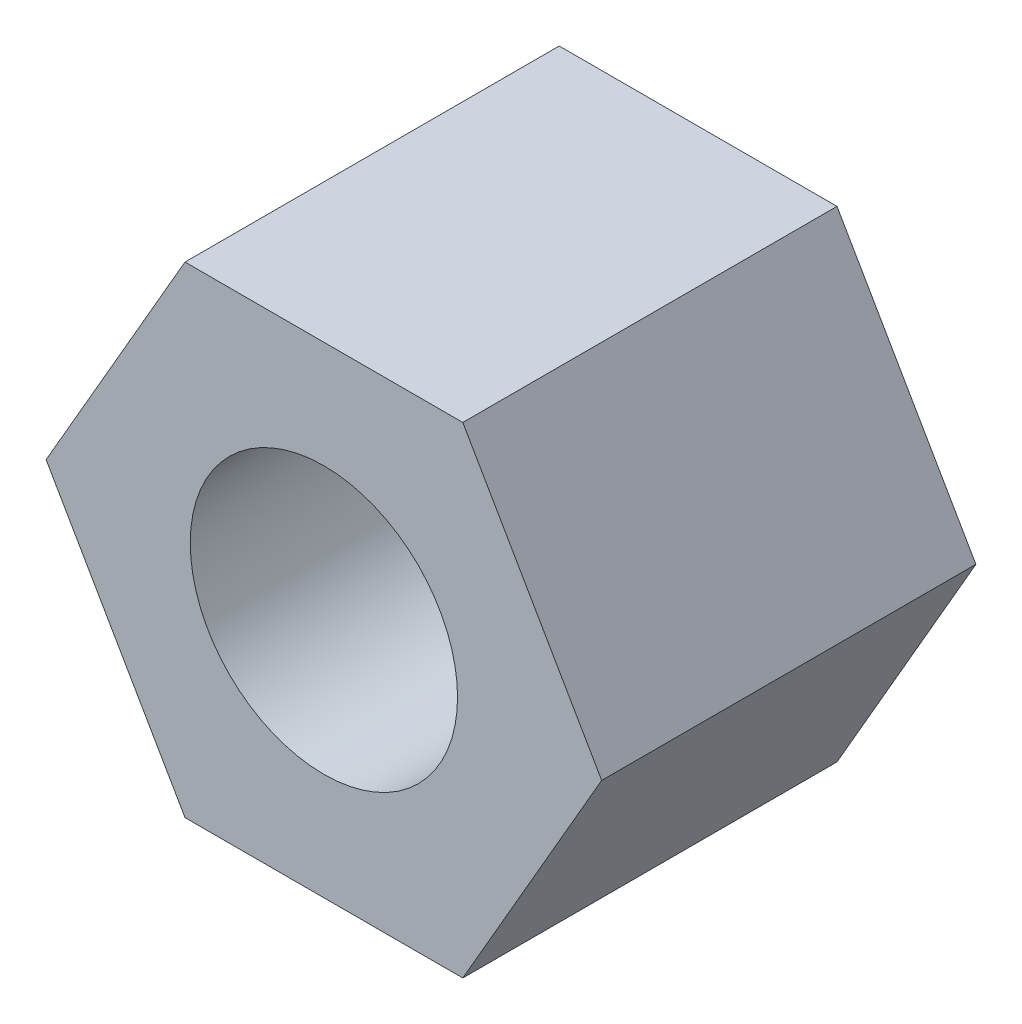
ISO-10303-21;
HEADER;
FILE_DESCRIPTION(('STEP AP214'),'2;1');
FILE_NAME('part.step','',(''),(''),'','','');
FILE_SCHEMA(('AUTOMOTIVE_DESIGN { 1 0 10303 214 1 1 1 1 }'));
ENDSEC;
DATA;
#1=APPLICATION_CONTEXT('core data for automotive mechanical design processes');
#2=APPLICATION_PROTOCOL_DEFINITION('international standard','automotive_design',2000,#1);
#3=PRODUCT_CONTEXT('',#1,'mechanical');
#4=PRODUCT('Part','Part','',(#3));
#5=PRODUCT_RELATED_PRODUCT_CATEGORY('part','',(#4));
#6=PRODUCT_DEFINITION_FORMATION('','',#4);
#7=PRODUCT_DEFINITION_CONTEXT('part definition',#1,'design');
#8=PRODUCT_DEFINITION('design','',#6,#7);
#9=PRODUCT_DEFINITION_SHAPE('','',#8);
#10=(LENGTH_UNIT() NAMED_UNIT(*) SI_UNIT(.MILLI.,.METRE.));
#11=(NAMED_UNIT(*) PLANE_ANGLE_UNIT() SI_UNIT($,.RADIAN.));
#12=(NAMED_UNIT(*) SI_UNIT($,.STERADIAN.) SOLID_ANGLE_UNIT());
#13=UNCERTAINTY_MEASURE_WITH_UNIT(LENGTH_MEASURE(1.E-05),#10,'distance_accuracy_value','');
#14=(GEOMETRIC_REPRESENTATION_CONTEXT(3) GLOBAL_UNCERTAINTY_ASSIGNED_CONTEXT((#13)) GLOBAL_UNIT_ASSIGNED_CONTEXT((#10,
#11,#12)) REPRESENTATION_CONTEXT('',''));
#15=CARTESIAN_POINT('',(0.,0.,0.));
#16=DIRECTION('',(0.,0.,1.));
#17=DIRECTION('',(1.,0.,0.));
#18=AXIS2_PLACEMENT_3D('',#15,#16,#17);
#19=CARTESIAN_POINT('',(0.,0.,3.5));
#20=DIRECTION('',(0.,0.,1.));
#21=DIRECTION('',(1.,0.,0.));
#22=AXIS2_PLACEMENT_3D('',#19,#20,#21);
#23=PLANE('',#22);
#24=DIRECTION('',(-0.5,-0.866025403784439,0.));
#25=VECTOR('',#24,1.);
#26=CARTESIAN_POINT('',(-1.29903810567666,2.25,3.5));
#27=LINE('',#26,#25);
#28=CARTESIAN_POINT('',(-1.29903810567666,2.25,3.5));
#29=VERTEX_POINT('',#28);
#30=CARTESIAN_POINT('',(-2.59807621135332,0.,3.5));
#31=VERTEX_POINT('',#30);
#32=EDGE_CURVE('E130',#29,#31,#27,.T.);
#33=ORIENTED_EDGE('',*,*,#32,.T.);
#34=DIRECTION('',(0.5,-0.866025403784439,0.));
#35=VECTOR('',#34,1.);
#36=CARTESIAN_POINT('',(-2.59807621135332,0.,3.5));
#37=LINE('',#36,#35);
#38=CARTESIAN_POINT('',(-1.29903810567666,-2.25,3.5));
#39=VERTEX_POINT('',#38);
#40=EDGE_CURVE('E88',#31,#39,#37,.T.);
#41=ORIENTED_EDGE('',*,*,#40,.T.);
#42=DIRECTION('',(1.,0.,0.));
#43=VECTOR('',#42,1.);
#44=CARTESIAN_POINT('',(-1.29903810567666,-2.25,3.5));
#45=LINE('',#44,#43);
#46=CARTESIAN_POINT('',(1.29903810567666,-2.25,3.5));
#47=VERTEX_POINT('',#46);
#48=EDGE_CURVE('E101',#39,#47,#45,.T.);
#49=ORIENTED_EDGE('',*,*,#48,.T.);
#50=DIRECTION('',(0.5,0.866025403784439,0.));
#51=VECTOR('',#50,1.);
#52=CARTESIAN_POINT('',(1.29903810567666,-2.25,3.5));
#53=LINE('',#52,#51);
#54=CARTESIAN_POINT('',(2.59807621135331,0.,3.5));
#55=VERTEX_POINT('',#54);
#56=EDGE_CURVE('E95',#47,#55,#53,.T.);
#57=ORIENTED_EDGE('',*,*,#56,.T.);
#58=DIRECTION('',(-0.5,0.866025403784439,0.));
#59=VECTOR('',#58,1.);
#60=CARTESIAN_POINT('',(2.59807621135331,0.,3.5));
#61=LINE('',#60,#59);
#62=CARTESIAN_POINT('',(1.29903810567666,2.25,3.5));
#63=VERTEX_POINT('',#62);
#64=EDGE_CURVE('E99',#55,#63,#61,.T.);
#65=ORIENTED_EDGE('',*,*,#64,.T.);
#66=DIRECTION('',(-1.,0.,0.));
#67=VECTOR('',#66,1.);
#68=CARTESIAN_POINT('',(1.29903810567666,2.25,3.5));
#69=LINE('',#68,#67);
#70=EDGE_CURVE('E51',#63,#29,#69,.T.);
#71=ORIENTED_EDGE('',*,*,#70,.T.);
#72=EDGE_LOOP('',(#33,#41,#49,#57,#65,#71));
#73=FACE_BOUND('',#72,.T.);
#74=CARTESIAN_POINT('',(0.,0.,3.5));
#75=DIRECTION('',(0.,0.,1.));
#76=DIRECTION('',(1.,0.,0.));
#77=AXIS2_PLACEMENT_3D('',#74,#75,#76);
#78=CIRCLE('',#77,1.25);
#79=CARTESIAN_POINT('',(1.25,0.,3.5));
#80=VERTEX_POINT('',#79);
#81=EDGE_CURVE('E123',#80,#80,#78,.T.);
#82=ORIENTED_EDGE('',*,*,#81,.F.);
#83=EDGE_LOOP('',(#82));
#84=FACE_BOUND('',#83,.T.);
#85=ADVANCED_FACE('F34',(#73,#84),#23,.T.);
#86=CARTESIAN_POINT('',(0.,0.,0.));
#87=DIRECTION('',(0.,0.,1.));
#88=DIRECTION('',(1.,0.,0.));
#89=AXIS2_PLACEMENT_3D('',#86,#87,#88);
#90=PLANE('',#89);
#91=DIRECTION('',(-0.5,-0.866025403784439,0.));
#92=VECTOR('',#91,1.);
#93=CARTESIAN_POINT('',(-1.29903810567666,2.25,0.));
#94=LINE('',#93,#92);
#95=CARTESIAN_POINT('',(-1.29903810567666,2.25,0.));
#96=VERTEX_POINT('',#95);
#97=CARTESIAN_POINT('',(-2.59807621135332,0.,0.));
#98=VERTEX_POINT('',#97);
#99=EDGE_CURVE('E119',#96,#98,#94,.T.);
#100=ORIENTED_EDGE('',*,*,#99,.F.);
#101=DIRECTION('',(-1.,0.,0.));
#102=VECTOR('',#101,1.);
#103=CARTESIAN_POINT('',(1.29903810567666,2.25,0.));
#104=LINE('',#103,#102);
#105=CARTESIAN_POINT('',(1.29903810567666,2.25,0.));
#106=VERTEX_POINT('',#105);
#107=EDGE_CURVE('E80',#106,#96,#104,.T.);
#108=ORIENTED_EDGE('',*,*,#107,.F.);
#109=DIRECTION('',(-0.5,0.866025403784439,0.));
#110=VECTOR('',#109,1.);
#111=CARTESIAN_POINT('',(2.59807621135331,0.,0.));
#112=LINE('',#111,#110);
#113=CARTESIAN_POINT('',(2.59807621135331,0.,0.));
#114=VERTEX_POINT('',#113);
#115=EDGE_CURVE('E74',#114,#106,#112,.T.);
#116=ORIENTED_EDGE('',*,*,#115,.F.);
#117=DIRECTION('',(0.5,0.866025403784439,0.));
#118=VECTOR('',#117,1.);
#119=CARTESIAN_POINT('',(1.29903810567666,-2.25,0.));
#120=LINE('',#119,#118);
#121=CARTESIAN_POINT('',(1.29903810567666,-2.25,0.));
#122=VERTEX_POINT('',#121);
#123=EDGE_CURVE('E109',#122,#114,#120,.T.);
#124=ORIENTED_EDGE('',*,*,#123,.F.);
#125=DIRECTION('',(1.,0.,0.));
#126=VECTOR('',#125,1.);
#127=CARTESIAN_POINT('',(-1.29903810567666,-2.25,0.));
#128=LINE('',#127,#126);
#129=CARTESIAN_POINT('',(-1.29903810567666,-2.25,0.));
#130=VERTEX_POINT('',#129);
#131=EDGE_CURVE('E125',#130,#122,#128,.T.);
#132=ORIENTED_EDGE('',*,*,#131,.F.);
#133=DIRECTION('',(0.5,-0.866025403784439,0.));
#134=VECTOR('',#133,1.);
#135=CARTESIAN_POINT('',(-2.59807621135332,0.,0.));
#136=LINE('',#135,#134);
#137=EDGE_CURVE('E122',#98,#130,#136,.T.);
#138=ORIENTED_EDGE('',*,*,#137,.F.);
#139=EDGE_LOOP('',(#100,#108,#116,#124,#132,#138));
#140=FACE_BOUND('',#139,.T.);
#141=CARTESIAN_POINT('',(0.,0.,0.));
#142=DIRECTION('',(0.,0.,1.));
#143=DIRECTION('',(1.,0.,0.));
#144=AXIS2_PLACEMENT_3D('',#141,#142,#143);
#145=CIRCLE('',#144,1.25);
#146=CARTESIAN_POINT('',(1.25,0.,0.));
#147=VERTEX_POINT('',#146);
#148=EDGE_CURVE('E223',#147,#147,#145,.T.);
#149=ORIENTED_EDGE('',*,*,#148,.T.);
#150=EDGE_LOOP('',(#149));
#151=FACE_BOUND('',#150,.T.);
#152=ADVANCED_FACE('F139',(#140,#151),#90,.F.);
#153=CARTESIAN_POINT('',(-1.29903810567666,2.25,3.5));
#154=DIRECTION('',(0.866025403784439,-0.5,0.));
#155=DIRECTION('',(0.5,0.866025403784439,0.));
#156=AXIS2_PLACEMENT_3D('',#153,#154,#155);
#157=PLANE('',#156);
#158=ORIENTED_EDGE('',*,*,#99,.T.);
#159=DIRECTION('',(0.,0.,-1.));
#160=VECTOR('',#159,1.);
#161=CARTESIAN_POINT('',(-2.59807621135332,0.,3.5));
#162=LINE('',#161,#160);
#163=EDGE_CURVE('E11',#31,#98,#162,.T.);
#164=ORIENTED_EDGE('',*,*,#163,.F.);
#165=ORIENTED_EDGE('',*,*,#32,.F.);
#166=DIRECTION('',(0.,0.,-1.));
#167=VECTOR('',#166,1.);
#168=CARTESIAN_POINT('',(-1.29903810567666,2.25,3.5));
#169=LINE('',#168,#167);
#170=EDGE_CURVE('E115',#29,#96,#169,.T.);
#171=ORIENTED_EDGE('',*,*,#170,.T.);
#172=EDGE_LOOP('',(#158,#164,#165,#171));
#173=FACE_BOUND('',#172,.T.);
#174=ADVANCED_FACE('F36',(#173),#157,.F.);
#175=CARTESIAN_POINT('',(-2.59807621135332,0.,3.5));
#176=DIRECTION('',(0.866025403784439,0.5,0.));
#177=DIRECTION('',(-0.5,0.866025403784439,0.));
#178=AXIS2_PLACEMENT_3D('',#175,#176,#177);
#179=PLANE('',#178);
#180=ORIENTED_EDGE('',*,*,#137,.T.);
#181=DIRECTION('',(0.,0.,-1.));
#182=VECTOR('',#181,1.);
#183=CARTESIAN_POINT('',(-1.29903810567666,-2.25,3.5));
#184=LINE('',#183,#182);
#185=EDGE_CURVE('E43',#39,#130,#184,.T.);
#186=ORIENTED_EDGE('',*,*,#185,.F.);
#187=ORIENTED_EDGE('',*,*,#40,.F.);
#188=ORIENTED_EDGE('',*,*,#163,.T.);
#189=EDGE_LOOP('',(#180,#186,#187,#188));
#190=FACE_BOUND('',#189,.T.);
#191=ADVANCED_FACE('F164',(#190),#179,.F.);
#192=CARTESIAN_POINT('',(-1.29903810567666,-2.25,3.5));
#193=DIRECTION('',(0.,1.,0.));
#194=DIRECTION('',(-1.,0.,0.));
#195=AXIS2_PLACEMENT_3D('',#192,#193,#194);
#196=PLANE('',#195);
#197=ORIENTED_EDGE('',*,*,#131,.T.);
#198=DIRECTION('',(0.,0.,-1.));
#199=VECTOR('',#198,1.);
#200=CARTESIAN_POINT('',(1.29903810567666,-2.25,3.5));
#201=LINE('',#200,#199);
#202=EDGE_CURVE('E110',#47,#122,#201,.T.);
#203=ORIENTED_EDGE('',*,*,#202,.F.);
#204=ORIENTED_EDGE('',*,*,#48,.F.);
#205=ORIENTED_EDGE('',*,*,#185,.T.);
#206=EDGE_LOOP('',(#197,#203,#204,#205));
#207=FACE_BOUND('',#206,.T.);
#208=ADVANCED_FACE('F136',(#207),#196,.F.);
#209=CARTESIAN_POINT('',(1.29903810567666,-2.25,3.5));
#210=DIRECTION('',(-0.866025403784439,0.5,0.));
#211=DIRECTION('',(-0.5,-0.866025403784439,0.));
#212=AXIS2_PLACEMENT_3D('',#209,#210,#211);
#213=PLANE('',#212);
#214=ORIENTED_EDGE('',*,*,#123,.T.);
#215=DIRECTION('',(0.,0.,-1.));
#216=VECTOR('',#215,1.);
#217=CARTESIAN_POINT('',(2.59807621135331,0.,3.5));
#218=LINE('',#217,#216);
#219=EDGE_CURVE('E106',#55,#114,#218,.T.);
#220=ORIENTED_EDGE('',*,*,#219,.F.);
#221=ORIENTED_EDGE('',*,*,#56,.F.);
#222=ORIENTED_EDGE('',*,*,#202,.T.);
#223=EDGE_LOOP('',(#214,#220,#221,#222));
#224=FACE_BOUND('',#223,.T.);
#225=ADVANCED_FACE('F107',(#224),#213,.F.);
#226=CARTESIAN_POINT('',(2.59807621135331,0.,3.5));
#227=DIRECTION('',(-0.866025403784439,-0.5,0.));
#228=DIRECTION('',(0.5,-0.866025403784439,0.));
#229=AXIS2_PLACEMENT_3D('',#226,#227,#228);
#230=PLANE('',#229);
#231=ORIENTED_EDGE('',*,*,#115,.T.);
#232=DIRECTION('',(0.,0.,-1.));
#233=VECTOR('',#232,1.);
#234=CARTESIAN_POINT('',(1.29903810567666,2.25,3.5));
#235=LINE('',#234,#233);
#236=EDGE_CURVE('E111',#63,#106,#235,.T.);
#237=ORIENTED_EDGE('',*,*,#236,.F.);
#238=ORIENTED_EDGE('',*,*,#64,.F.);
#239=ORIENTED_EDGE('',*,*,#219,.T.);
#240=EDGE_LOOP('',(#231,#237,#238,#239));
#241=FACE_BOUND('',#240,.T.);
#242=ADVANCED_FACE('F113',(#241),#230,.F.);
#243=CARTESIAN_POINT('',(1.29903810567666,2.25,3.5));
#244=DIRECTION('',(0.,-1.,0.));
#245=DIRECTION('',(0.,0.,-1.));
#246=AXIS2_PLACEMENT_3D('',#243,#244,#245);
#247=PLANE('',#246);
#248=ORIENTED_EDGE('',*,*,#107,.T.);
#249=ORIENTED_EDGE('',*,*,#170,.F.);
#250=ORIENTED_EDGE('',*,*,#70,.F.);
#251=ORIENTED_EDGE('',*,*,#236,.T.);
#252=EDGE_LOOP('',(#248,#249,#250,#251));
#253=FACE_BOUND('',#252,.T.);
#254=ADVANCED_FACE('F144',(#253),#247,.F.);
#255=CARTESIAN_POINT('',(0.,0.,3.5));
#256=DIRECTION('',(0.,0.,-1.));
#257=DIRECTION('',(-1.,0.,0.));
#258=AXIS2_PLACEMENT_3D('',#255,#256,#257);
#259=CYLINDRICAL_SURFACE('',#258,1.25);
#260=ORIENTED_EDGE('',*,*,#81,.T.);
#261=EDGE_LOOP('',(#260));
#262=FACE_BOUND('',#261,.T.);
#263=ORIENTED_EDGE('',*,*,#148,.F.);
#264=EDGE_LOOP('',(#263));
#265=FACE_BOUND('',#264,.T.);
#266=ADVANCED_FACE('F146',(#262,#265),#259,.F.);
#267=CLOSED_SHELL('',(#85,#152,#174,#191,#208,#225,#242,#254,#266));
#268=MANIFOLD_SOLID_BREP('B2',#267);
#269=ADVANCED_BREP_SHAPE_REPRESENTATION('',(#18,#268),#14);
#270=SHAPE_DEFINITION_REPRESENTATION(#9,#269);
ENDSEC;
END-ISO-10303-21;
